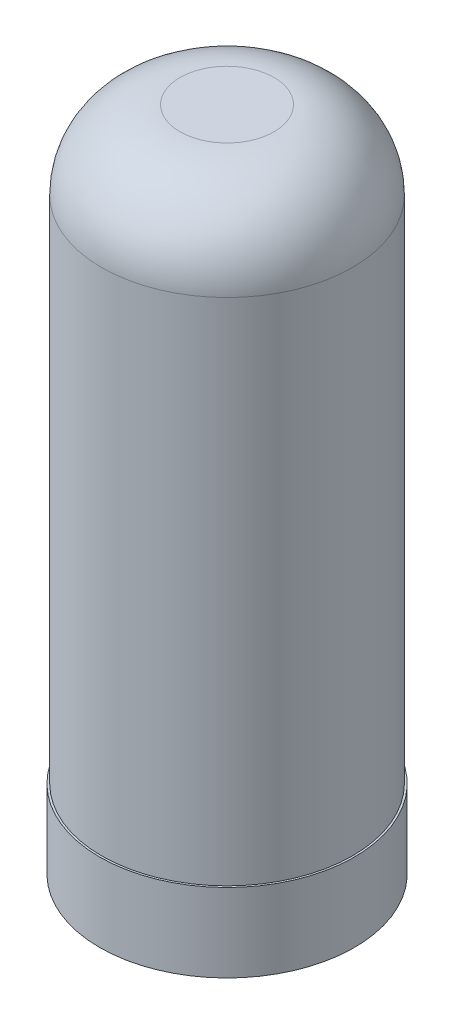
ISO-10303-21;
HEADER;
FILE_DESCRIPTION(('STEP AP214'),'2;1');
FILE_NAME('part.step','',(''),(''),'','','');
FILE_SCHEMA(('AUTOMOTIVE_DESIGN { 1 0 10303 214 1 1 1 1 }'));
ENDSEC;
DATA;
#1=APPLICATION_CONTEXT('core data for automotive mechanical design processes');
#2=APPLICATION_PROTOCOL_DEFINITION('international standard','automotive_design',2000,#1);
#3=PRODUCT_CONTEXT('',#1,'mechanical');
#4=PRODUCT('Part','Part','',(#3));
#5=PRODUCT_RELATED_PRODUCT_CATEGORY('part','',(#4));
#6=PRODUCT_DEFINITION_FORMATION('','',#4);
#7=PRODUCT_DEFINITION_CONTEXT('part definition',#1,'design');
#8=PRODUCT_DEFINITION('design','',#6,#7);
#9=PRODUCT_DEFINITION_SHAPE('','',#8);
#10=(LENGTH_UNIT() NAMED_UNIT(*) SI_UNIT(.MILLI.,.METRE.));
#11=(NAMED_UNIT(*) PLANE_ANGLE_UNIT() SI_UNIT($,.RADIAN.));
#12=(NAMED_UNIT(*) SI_UNIT($,.STERADIAN.) SOLID_ANGLE_UNIT());
#13=UNCERTAINTY_MEASURE_WITH_UNIT(LENGTH_MEASURE(1.E-05),#10,'distance_accuracy_value','');
#14=(GEOMETRIC_REPRESENTATION_CONTEXT(3) GLOBAL_UNCERTAINTY_ASSIGNED_CONTEXT((#13)) GLOBAL_UNIT_ASSIGNED_CONTEXT((#10,
#11,#12)) REPRESENTATION_CONTEXT('',''));
#15=CARTESIAN_POINT('',(0.,0.,0.));
#16=DIRECTION('',(0.,0.,1.));
#17=DIRECTION('',(1.,0.,0.));
#18=AXIS2_PLACEMENT_3D('',#15,#16,#17);
#19=CARTESIAN_POINT('',(0.,20.,0.));
#20=DIRECTION('',(0.,1.,0.));
#21=DIRECTION('',(0.,0.,1.));
#22=AXIS2_PLACEMENT_3D('',#19,#20,#21);
#23=PLANE('',#22);
#24=CARTESIAN_POINT('',(0.,20.,0.));
#25=DIRECTION('',(0.,1.,0.));
#26=DIRECTION('',(0.,0.,1.));
#27=AXIS2_PLACEMENT_3D('',#24,#25,#26);
#28=CIRCLE('',#27,32.);
#29=CARTESIAN_POINT('',(0.,20.,32.));
#30=VERTEX_POINT('',#29);
#31=EDGE_CURVE('E44',#30,#30,#28,.T.);
#32=ORIENTED_EDGE('',*,*,#31,.F.);
#33=EDGE_LOOP('',(#32));
#34=FACE_BOUND('',#33,.T.);
#35=CARTESIAN_POINT('',(0.,20.,0.));
#36=DIRECTION('',(0.,1.,0.));
#37=DIRECTION('',(0.,0.,1.));
#38=AXIS2_PLACEMENT_3D('',#35,#36,#37);
#39=CIRCLE('',#38,32.5);
#40=CARTESIAN_POINT('',(0.,20.,32.5));
#41=VERTEX_POINT('',#40);
#42=EDGE_CURVE('E48',#41,#41,#39,.T.);
#43=ORIENTED_EDGE('',*,*,#42,.T.);
#44=EDGE_LOOP('',(#43));
#45=FACE_BOUND('',#44,.T.);
#46=ADVANCED_FACE('F33',(#34,#45),#23,.T.);
#47=CARTESIAN_POINT('',(0.,0.,0.));
#48=DIRECTION('',(0.,1.,0.));
#49=DIRECTION('',(0.,0.,1.));
#50=AXIS2_PLACEMENT_3D('',#47,#48,#49);
#51=PLANE('',#50);
#52=CARTESIAN_POINT('',(0.,0.,0.));
#53=DIRECTION('',(0.,1.,0.));
#54=DIRECTION('',(0.,0.,1.));
#55=AXIS2_PLACEMENT_3D('',#52,#53,#54);
#56=CIRCLE('',#55,32.5);
#57=CARTESIAN_POINT('',(0.,0.,32.5));
#58=VERTEX_POINT('',#57);
#59=EDGE_CURVE('E51',#58,#58,#56,.T.);
#60=ORIENTED_EDGE('',*,*,#59,.F.);
#61=EDGE_LOOP('',(#60));
#62=FACE_BOUND('',#61,.T.);
#63=CARTESIAN_POINT('',(0.,0.,0.));
#64=DIRECTION('',(0.,1.,0.));
#65=DIRECTION('',(0.,0.,1.));
#66=AXIS2_PLACEMENT_3D('',#63,#64,#65);
#67=CIRCLE('',#66,3.25);
#68=CARTESIAN_POINT('',(0.,0.,3.25));
#69=VERTEX_POINT('',#68);
#70=EDGE_CURVE('E54',#69,#69,#67,.T.);
#71=ORIENTED_EDGE('',*,*,#70,.T.);
#72=EDGE_LOOP('',(#71));
#73=FACE_BOUND('',#72,.T.);
#74=ADVANCED_FACE('F79',(#62,#73),#51,.F.);
#75=CARTESIAN_POINT('',(0.,20.,0.));
#76=DIRECTION('',(0.,-1.,0.));
#77=DIRECTION('',(0.,0.,-1.));
#78=AXIS2_PLACEMENT_3D('',#75,#76,#77);
#79=CYLINDRICAL_SURFACE('',#78,32.5);
#80=ORIENTED_EDGE('',*,*,#42,.F.);
#81=EDGE_LOOP('',(#80));
#82=FACE_BOUND('',#81,.T.);
#83=ORIENTED_EDGE('',*,*,#59,.T.);
#84=EDGE_LOOP('',(#83));
#85=FACE_BOUND('',#84,.T.);
#86=ADVANCED_FACE('F85',(#82,#85),#79,.T.);
#87=CARTESIAN_POINT('',(0.,20.,0.));
#88=DIRECTION('',(0.,-1.,0.));
#89=DIRECTION('',(0.,0.,-1.));
#90=AXIS2_PLACEMENT_3D('',#87,#88,#89);
#91=CYLINDRICAL_SURFACE('',#90,3.25);
#92=CARTESIAN_POINT('',(0.,20.,0.));
#93=DIRECTION('',(0.,1.,0.));
#94=DIRECTION('',(0.,0.,1.));
#95=AXIS2_PLACEMENT_3D('',#92,#93,#94);
#96=CIRCLE('',#95,3.25);
#97=CARTESIAN_POINT('',(0.,20.,3.25));
#98=VERTEX_POINT('',#97);
#99=EDGE_CURVE('E59',#98,#98,#96,.T.);
#100=ORIENTED_EDGE('',*,*,#99,.T.);
#101=EDGE_LOOP('',(#100));
#102=FACE_BOUND('',#101,.T.);
#103=ORIENTED_EDGE('',*,*,#70,.F.);
#104=EDGE_LOOP('',(#103));
#105=FACE_BOUND('',#104,.T.);
#106=ADVANCED_FACE('F63',(#102,#105),#91,.F.);
#107=CARTESIAN_POINT('',(0.,170.,0.));
#108=DIRECTION('',(0.,1.,0.));
#109=DIRECTION('',(0.,0.,1.));
#110=AXIS2_PLACEMENT_3D('',#107,#108,#109);
#111=PLANE('',#110);
#112=CARTESIAN_POINT('',(0.,170.,0.));
#113=DIRECTION('',(0.,1.,0.));
#114=DIRECTION('',(0.,0.,1.));
#115=AXIS2_PLACEMENT_3D('',#112,#113,#114);
#116=CIRCLE('',#115,12.);
#117=CARTESIAN_POINT('',(0.,170.,12.));
#118=VERTEX_POINT('',#117);
#119=EDGE_CURVE('E40',#118,#118,#116,.T.);
#120=ORIENTED_EDGE('',*,*,#119,.T.);
#121=EDGE_LOOP('',(#120));
#122=FACE_BOUND('',#121,.T.);
#123=ADVANCED_FACE('F75',(#122),#111,.T.);
#124=CARTESIAN_POINT('',(0.,170.,0.));
#125=DIRECTION('',(0.,-1.,0.));
#126=DIRECTION('',(0.,0.,-1.));
#127=AXIS2_PLACEMENT_3D('',#124,#125,#126);
#128=CYLINDRICAL_SURFACE('',#127,32.);
#129=CARTESIAN_POINT('',(0.,150.,0.));
#130=DIRECTION('',(0.,1.,0.));
#131=DIRECTION('',(0.,0.,1.));
#132=AXIS2_PLACEMENT_3D('',#129,#130,#131);
#133=CIRCLE('',#132,32.);
#134=CARTESIAN_POINT('',(0.,150.,32.));
#135=VERTEX_POINT('',#134);
#136=EDGE_CURVE('E10',#135,#135,#133,.F.);
#137=ORIENTED_EDGE('',*,*,#136,.T.);
#138=EDGE_LOOP('',(#137));
#139=FACE_BOUND('',#138,.T.);
#140=ORIENTED_EDGE('',*,*,#31,.T.);
#141=EDGE_LOOP('',(#140));
#142=FACE_BOUND('',#141,.T.);
#143=ADVANCED_FACE('F68',(#139,#142),#128,.T.);
#144=CARTESIAN_POINT('',(0.,20.,0.));
#145=DIRECTION('',(0.,1.,0.));
#146=DIRECTION('',(0.,0.,1.));
#147=AXIS2_PLACEMENT_3D('',#144,#145,#146);
#148=PLANE('',#147);
#149=ORIENTED_EDGE('',*,*,#99,.F.);
#150=EDGE_LOOP('',(#149));
#151=FACE_BOUND('',#150,.T.);
#152=ADVANCED_FACE('F66',(#151),#148,.F.);
#153=CARTESIAN_POINT('',(0.,150.,0.));
#154=DIRECTION('',(0.,1.,0.));
#155=DIRECTION('',(0.,0.,1.));
#156=AXIS2_PLACEMENT_3D('',#153,#154,#155);
#157=DEGENERATE_TOROIDAL_SURFACE('',#156,12.,20.,.T.);
#158=ORIENTED_EDGE('',*,*,#136,.F.);
#159=EDGE_LOOP('',(#158));
#160=FACE_BOUND('',#159,.T.);
#161=ORIENTED_EDGE('',*,*,#119,.F.);
#162=EDGE_LOOP('',(#161));
#163=FACE_BOUND('',#162,.T.);
#164=ADVANCED_FACE('F35',(#160,#163),#157,.T.);
#165=CLOSED_SHELL('',(#46,#74,#86,#106,#123,#143,#152,#164));
#166=MANIFOLD_SOLID_BREP('B2',#165);
#167=ADVANCED_BREP_SHAPE_REPRESENTATION('',(#18,#166),#14);
#168=SHAPE_DEFINITION_REPRESENTATION(#9,#167);
ENDSEC;
END-ISO-10303-21;
